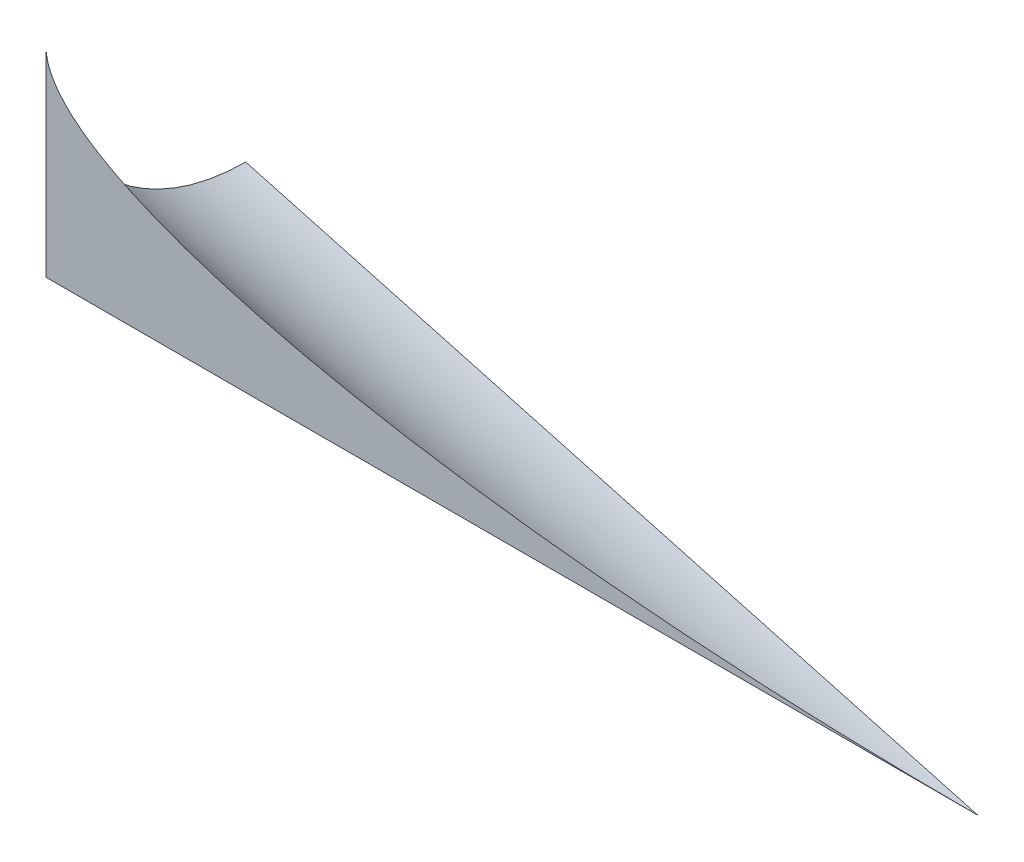
ISO-10303-21;
HEADER;
FILE_DESCRIPTION(('STEP AP214'),'2;1');
FILE_NAME('part.step','',(''),(''),'','','');
FILE_SCHEMA(('AUTOMOTIVE_DESIGN { 1 0 10303 214 1 1 1 1 }'));
ENDSEC;
DATA;
#1=APPLICATION_CONTEXT('core data for automotive mechanical design processes');
#2=APPLICATION_PROTOCOL_DEFINITION('international standard','automotive_design',2000,#1);
#3=PRODUCT_CONTEXT('',#1,'mechanical');
#4=PRODUCT('Part','Part','',(#3));
#5=PRODUCT_RELATED_PRODUCT_CATEGORY('part','',(#4));
#6=PRODUCT_DEFINITION_FORMATION('','',#4);
#7=PRODUCT_DEFINITION_CONTEXT('part definition',#1,'design');
#8=PRODUCT_DEFINITION('design','',#6,#7);
#9=PRODUCT_DEFINITION_SHAPE('','',#8);
#10=(LENGTH_UNIT() NAMED_UNIT(*) SI_UNIT(.MILLI.,.METRE.));
#11=(NAMED_UNIT(*) PLANE_ANGLE_UNIT() SI_UNIT($,.RADIAN.));
#12=(NAMED_UNIT(*) SI_UNIT($,.STERADIAN.) SOLID_ANGLE_UNIT());
#13=UNCERTAINTY_MEASURE_WITH_UNIT(LENGTH_MEASURE(1.E-05),#10,'distance_accuracy_value','');
#14=(GEOMETRIC_REPRESENTATION_CONTEXT(3) GLOBAL_UNCERTAINTY_ASSIGNED_CONTEXT((#13)) GLOBAL_UNIT_ASSIGNED_CONTEXT((#10,
#11,#12)) REPRESENTATION_CONTEXT('',''));
#15=CARTESIAN_POINT('',(0.,0.,0.));
#16=DIRECTION('',(0.,0.,1.));
#17=DIRECTION('',(1.,0.,0.));
#18=AXIS2_PLACEMENT_3D('',#15,#16,#17);
#19=CARTESIAN_POINT('',(70.,0.,0.));
#20=DIRECTION('',(0.,0.,-1.));
#21=DIRECTION('',(-1.,0.,0.));
#22=AXIS2_PLACEMENT_3D('',#19,#20,#21);
#23=PLANE('',#22);
#24=CARTESIAN_POINT('',(0.,15.,0.));
#25=CARTESIAN_POINT('',(-3.63660619727924E-06,14.9416797201866,0.));
#26=CARTESIAN_POINT('',(0.00158799671305643,14.8833713625419,0.));
#27=CARTESIAN_POINT('',(0.00792342881544762,14.7669350517663,0.));
#28=CARTESIAN_POINT('',(0.0126667331019242,14.7088070717713,0.));
#29=CARTESIAN_POINT('',(0.0315360967114692,14.5351887119626,0.));
#30=CARTESIAN_POINT('',(0.0503020053934032,14.4201730371477,0.));
#31=CARTESIAN_POINT('',(0.0989940874013959,14.1947272654307,0.));
#32=CARTESIAN_POINT('',(0.128715334241776,14.0842519732819,0.));
#33=CARTESIAN_POINT('',(0.19828864153702,13.8664977455663,0.));
#34=CARTESIAN_POINT('',(0.238146433679211,13.7592206568868,0.));
#35=CARTESIAN_POINT('',(0.336941329424818,13.5242763985346,0.));
#36=CARTESIAN_POINT('',(0.39815754814037,13.3975703748656,0.));
#37=CARTESIAN_POINT('',(0.531837614136608,13.1502757636842,0.));
#38=CARTESIAN_POINT('',(0.604304278949745,13.029688718658,0.));
#39=CARTESIAN_POINT('',(0.759023327721108,12.7938113342404,0.));
#40=CARTESIAN_POINT('',(0.841340078549202,12.6785635176265,0.));
#41=CARTESIAN_POINT('',(1.01364735337626,12.4540106430114,0.));
#42=CARTESIAN_POINT('',(1.1036378081401,12.3447055314074,0.));
#43=CARTESIAN_POINT('',(1.36899046280035,12.0411384860095,0.));
#44=CARTESIAN_POINT('',(1.55197279485321,11.8535283837303,0.));
#45=CARTESIAN_POINT('',(1.93309957195739,11.4943771196236,0.));
#46=CARTESIAN_POINT('',(2.13125804643337,11.3228511604695,0.));
#47=CARTESIAN_POINT('',(2.53875216874704,10.993298567786,0.));
#48=CARTESIAN_POINT('',(2.74809902135869,10.8352858951645,2.24750434950866E-13));
#49=CARTESIAN_POINT('',(3.17491252228697,10.5309377356269,-2.24652907264791E-13));
#50=CARTESIAN_POINT('',(3.39237560769774,10.3845972112937,-8.38363395489756E-13));
#51=CARTESIAN_POINT('',(3.79933964351344,10.1238000544291,-7.2683406795201E-13));
#52=CARTESIAN_POINT('',(3.9879362152439,10.0079220289254,-1.94792729622459E-13));
#53=CARTESIAN_POINT('',(4.36883546232187,9.78240270478851,1.94810197500429E-13));
#54=CARTESIAN_POINT('',(4.56113846849459,9.6727619663606,0.));
#55=CARTESIAN_POINT('',(4.94902738184981,9.45890999454986,0.));
#56=CARTESIAN_POINT('',(5.14461689821293,9.35470532692088,0.));
#57=CARTESIAN_POINT('',(5.53837771732633,9.15128357379421,0.));
#58=CARTESIAN_POINT('',(5.73654916582174,9.05206677140135,0.));
#59=CARTESIAN_POINT('',(6.33489750678614,8.76087070118379,0.));
#60=CARTESIAN_POINT('',(6.73836705818669,8.57564005659975,0.));
#61=CARTESIAN_POINT('',(7.55184718150086,8.22003012820233,0.));
#62=CARTESIAN_POINT('',(7.96185929465577,8.04965440676047,0.));
#63=CARTESIAN_POINT('',(8.78909896141301,7.72062253991202,0.));
#64=CARTESIAN_POINT('',(9.20635347629733,7.56203442448619,0.));
#65=CARTESIAN_POINT('',(10.0443528425527,7.25599575487862,0.));
#66=CARTESIAN_POINT('',(10.4650930132975,7.10853232480601,0.));
#67=CARTESIAN_POINT('',(11.3095551473358,6.82323058800587,0.));
#68=CARTESIAN_POINT('',(11.7332753358362,6.6853870113796,0.));
#69=CARTESIAN_POINT('',(12.5832972785961,6.41815434873623,0.));
#70=CARTESIAN_POINT('',(13.0095986465151,6.2887640300584,0.));
#71=CARTESIAN_POINT('',(13.9083448397191,6.02460914388393,0.));
#72=CARTESIAN_POINT('',(14.3810286927217,5.89065919081945,0.));
#73=CARTESIAN_POINT('',(15.3286480081518,5.63094729304768,0.));
#74=CARTESIAN_POINT('',(15.8035835333809,5.50518557817794,0.));
#75=CARTESIAN_POINT('',(16.7556201904174,5.26098505395116,0.));
#76=CARTESIAN_POINT('',(17.2327224069842,5.14255048099791,0.));
#77=CARTESIAN_POINT('',(18.188552438535,4.91242146923049,0.));
#78=CARTESIAN_POINT('',(18.6672802797161,4.80072713958517,0.));
#79=CARTESIAN_POINT('',(20.1060334973665,4.47478751961319,0.));
#80=CARTESIAN_POINT('',(21.068165186435,4.26980318428094,0.));
#81=CARTESIAN_POINT('',(22.9967219937272,3.88098173252049,0.));
#82=CARTESIAN_POINT('',(23.9631474046052,3.69714608125698,0.));
#83=CARTESIAN_POINT('',(25.896363850175,3.34857029928486,0.));
#84=CARTESIAN_POINT('',(26.8631446682574,3.18377331881414,0.));
#85=CARTESIAN_POINT('',(28.7989922766365,2.87069711426926,0.));
#86=CARTESIAN_POINT('',(29.7680580699458,2.72241169856148,0.));
#87=CARTESIAN_POINT('',(31.7081779605063,2.44075685961862,0.));
#88=CARTESIAN_POINT('',(32.6792316874287,2.30738487732229,0.));
#89=CARTESIAN_POINT('',(34.6230741796986,2.05429405451251,0.));
#90=CARTESIAN_POINT('',(35.5958628798481,1.93457471149044,0.));
#91=CARTESIAN_POINT('',(37.6791107579697,1.69191560491805,0.));
#92=CARTESIAN_POINT('',(38.7897902178065,1.57086854000406,0.));
#93=CARTESIAN_POINT('',(41.0128037887493,1.3440000990598,0.));
#94=CARTESIAN_POINT('',(42.125138047668,1.23818017737441,0.));
#95=CARTESIAN_POINT('',(44.3511961273619,1.04081964466208,0.));
#96=CARTESIAN_POINT('',(45.4649200911137,0.949280650553655,0.));
#97=CARTESIAN_POINT('',(47.6935053606347,0.779727325414758,0.));
#98=CARTESIAN_POINT('',(48.8083667683599,0.701714338281896,0.));
#99=CARTESIAN_POINT('',(51.0389876471249,0.558612674122894,0.));
#100=CARTESIAN_POINT('',(52.1547471706341,0.493524817040189,0.));
#101=CARTESIAN_POINT('',(54.3853871936608,0.375881076316622,0.));
#102=CARTESIAN_POINT('',(55.5002667934572,0.323308090499159,0.));
#103=CARTESIAN_POINT('',(57.7304691470951,0.230211703753154,0.));
#104=CARTESIAN_POINT('',(58.845791874585,0.189687670087469,0.));
#105=CARTESIAN_POINT('',(61.0766463671227,0.120416465232,0.));
#106=CARTESIAN_POINT('',(62.1921780812733,0.0916676512383976,0.));
#107=CARTESIAN_POINT('',(64.4232182049194,0.0457498428426269,0.));
#108=CARTESIAN_POINT('',(65.538726558852,0.0285781418671018,0.));
#109=CARTESIAN_POINT('',(67.7694902878698,0.00571183244050842,0.));
#110=CARTESIAN_POINT('',(68.8847456238221,1.34115856096303E-05,0.));
#111=CARTESIAN_POINT('',(70.,0.,0.));
#112=B_SPLINE_CURVE_WITH_KNOTS('',3,(#24,#25,#26,#27,#28,#29,#30,#31,#32,#33,#34,#35,#36,#37,
#38,#39,#40,#41,#42,#43,#44,#45,#46,#47,#48,#49,#50,#51,#52,#53,#54,#55,#56,#57,#58,#59,#60,#61,
#62,#63,#64,#65,#66,#67,#68,#69,#70,#71,#72,#73,#74,#75,#76,#77,#78,#79,#80,#81,#82,#83,#84,#85,
#86,#87,#88,#89,#90,#91,#92,#93,#94,#95,#96,#97,#98,#99,#100,#101,#102,#103,#104,#105,#106,#107,
#108,#109,#110,#111),.UNSPECIFIED.,.F.,.F.,(4,2,2,2,2,2,2,2,2,2,2,2,2,2,2,2,2,2,2,2,2,2,2,2,2,2,
2,2,2,2,2,2,2,2,2,2,2,2,2,2,2,2,2,4),(0.,0.174916028507103,0.349804619196399,0.698713773888168,
1.04140267124691,1.3842857738044,1.80574581667926,2.2273115796835,2.65180033164246,
3.07628525410499,3.86112809555294,4.64670544382071,5.4330848263414,6.2191229692041,
6.88304761882909,7.54703180535151,8.21180022557048,8.87660633469059,10.2080651725745,
11.5398424355001,12.8787893018371,14.2161618847846,15.5527959888396,16.8892347467977,
18.3630412151018,19.8368890342025,21.3115811880366,22.7862972204228,25.7371630290879,
28.6882331485292,31.630250192778,34.5711602749209,37.5115649365079,40.4518613365419,
43.803513679782,47.1554859272594,50.5078374175187,53.8605217952767,57.2134187924789,
60.5617072473188,63.9098198394961,67.2574651650456,70.6043275844901,73.9500777066526),.UNSPECIFIED.);
#113=CARTESIAN_POINT('',(0.,15.,0.));
#114=VERTEX_POINT('',#113);
#115=CARTESIAN_POINT('',(70.,0.,0.));
#116=VERTEX_POINT('',#115);
#117=EDGE_CURVE('E57',#114,#116,#112,.T.);
#118=ORIENTED_EDGE('',*,*,#117,.F.);
#119=DIRECTION('',(0.,-1.,0.));
#120=VECTOR('',#119,1.);
#121=CARTESIAN_POINT('',(0.,0.,0.));
#122=LINE('',#121,#120);
#123=CARTESIAN_POINT('',(0.,0.,0.));
#124=VERTEX_POINT('',#123);
#125=EDGE_CURVE('E63',#114,#124,#122,.T.);
#126=ORIENTED_EDGE('',*,*,#125,.T.);
#127=DIRECTION('',(-1.,0.,0.));
#128=VECTOR('',#127,1.);
#129=CARTESIAN_POINT('',(70.,0.,0.));
#130=LINE('',#129,#128);
#131=EDGE_CURVE('E37',#116,#124,#130,.T.);
#132=ORIENTED_EDGE('',*,*,#131,.F.);
#133=EDGE_LOOP('',(#118,#126,#132));
#134=FACE_BOUND('',#133,.T.);
#135=ADVANCED_FACE('F33',(#134),#23,.F.);
#136=CARTESIAN_POINT('',(70.,0.,0.));
#137=DIRECTION('',(0.,1.,0.));
#138=DIRECTION('',(0.,0.,1.));
#139=AXIS2_PLACEMENT_3D('',#136,#137,#138);
#140=PLANE('',#139);
#141=DIRECTION('',(0.,0.,-1.));
#142=VECTOR('',#141,1.);
#143=CARTESIAN_POINT('',(0.,0.,0.));
#144=LINE('',#143,#142);
#145=CARTESIAN_POINT('',(0.,0.,-15.));
#146=VERTEX_POINT('',#145);
#147=EDGE_CURVE('E68',#124,#146,#144,.T.);
#148=ORIENTED_EDGE('',*,*,#147,.T.);
#149=DIRECTION('',(0.977802414077409,0.,0.209529088730873));
#150=VECTOR('',#149,1.);
#151=CARTESIAN_POINT('',(-1.00023861810054,0.,-15.2143368467358));
#152=LINE('',#151,#150);
#153=EDGE_CURVE('E11',#146,#116,#152,.T.);
#154=ORIENTED_EDGE('',*,*,#153,.T.);
#155=ORIENTED_EDGE('',*,*,#131,.T.);
#156=EDGE_LOOP('',(#148,#154,#155));
#157=FACE_BOUND('',#156,.T.);
#158=ADVANCED_FACE('F67',(#157),#140,.F.);
#159=CARTESIAN_POINT('',(0.,0.,0.));
#160=DIRECTION('',(-1.,0.,0.));
#161=DIRECTION('',(0.,0.,1.));
#162=AXIS2_PLACEMENT_3D('',#159,#160,#161);
#163=PLANE('',#162);
#164=CARTESIAN_POINT('',(0.,0.,-15.));
#165=CARTESIAN_POINT('',(0.,-4.53655645734542E-05,-14.5781091128024));
#166=CARTESIAN_POINT('',(0.,0.0177972882038559,-14.1562247412463));
#167=CARTESIAN_POINT('',(0.,0.0889309735316458,-13.3154744819859));
#168=CARTESIAN_POINT('',(0.,0.142220304648244,-12.8966084504605));
#169=CARTESIAN_POINT('',(0.,0.28386620676841,-12.0651735183838));
#170=CARTESIAN_POINT('',(0.,0.372196249920546,-11.652600098764));
#171=CARTESIAN_POINT('',(0.,0.58328100603723,-10.83636145296));
#172=CARTESIAN_POINT('',(0.,0.706035298778612,-10.4326961180979));
#173=CARTESIAN_POINT('',(0.,0.985168921092279,-9.63694228084863));
#174=CARTESIAN_POINT('',(0.,1.14156460985925,-9.24485951672981));
#175=CARTESIAN_POINT('',(0.,1.48683262533932,-8.47526417746285));
#176=CARTESIAN_POINT('',(0.,1.67570495913211,-8.09775160549095));
#177=CARTESIAN_POINT('',(0.,2.08454794040079,-7.36004525621706));
#178=CARTESIAN_POINT('',(0.,2.30451317708539,-6.99984848020201));
#179=CARTESIAN_POINT('',(0.,2.77400181246558,-6.2992657686178));
#180=CARTESIAN_POINT('',(0.,3.02352505192002,-5.95887972633476));
#181=CARTESIAN_POINT('',(0.,3.55035445406677,-5.30033911065094));
#182=CARTESIAN_POINT('',(0.,3.82766034578778,-4.98218432047443));
#183=CARTESIAN_POINT('',(0.,4.40808749515107,-4.37036237513932));
#184=CARTESIAN_POINT('',(0.,4.71120889062417,-4.07669535073923));
#185=CARTESIAN_POINT('',(0.,5.34117467795882,-3.5158818007462));
#186=CARTESIAN_POINT('',(0.,5.66802382595374,-3.24874061770288));
#187=CARTESIAN_POINT('',(0.,6.34306144639887,-2.74294942675402));
#188=CARTESIAN_POINT('',(0.,6.69124959035355,-2.5042989804247));
#189=CARTESIAN_POINT('',(0.,7.40656687121694,-2.05713661992116));
#190=CARTESIAN_POINT('',(0.,7.7736997776458,-1.84863073535975));
#191=CARTESIAN_POINT('',(0.,8.52422859026486,-1.46329640447777));
#192=CARTESIAN_POINT('',(0.,8.90762462371376,-1.28646820609115));
#193=CARTESIAN_POINT('',(0.,9.6877856722118,-0.965823172037951));
#194=CARTESIAN_POINT('',(0.,10.0845442998625,-0.821990813958746));
#195=CARTESIAN_POINT('',(0.,10.8886102433383,-0.56828949056116));
#196=CARTESIAN_POINT('',(0.,11.2959149978668,-0.458412360984244));
#197=CARTESIAN_POINT('',(0.,12.2473896272249,-0.244346217808977));
#198=CARTESIAN_POINT('',(0.,12.7944676298442,-0.152719415507454));
#199=CARTESIAN_POINT('',(0.,13.6194385152426,-0.0611027908368757));
#200=CARTESIAN_POINT('',(0.,13.8949950557476,-0.0382012033252767));
#201=CARTESIAN_POINT('',(0.,14.4470116261991,-0.00764953260081119));
#202=CARTESIAN_POINT('',(0.,14.7234718369493,-2.71574079515337E-06));
#203=CARTESIAN_POINT('',(0.,15.,0.));
#204=B_SPLINE_CURVE_WITH_KNOTS('',3,(#164,#165,#166,#167,#168,#169,#170,#171,#172,#173,#174,
#175,#176,#177,#178,#179,#180,#181,#182,#183,#184,#185,#186,#187,#188,#189,#190,#191,#192,#193,
#194,#195,#196,#197,#198,#199,#200,#201,#202,#203),.UNSPECIFIED.,.F.,.F.,(4,2,2,2,2,2,2,2,2,2,2,
2,2,2,2,2,2,2,2,4),(0.,1.26528633830921,2.53051198286646,3.79478160059314,5.0590357858191,
6.32390615016246,7.58877679023912,8.8534275877129,10.1180715723006,11.3827032236926,
12.6473416274669,13.9122342266416,15.1771073587692,16.4422331459094,17.707368834465,
18.9719081322543,20.2361431448616,21.8963769384548,22.7255425850935,23.5548857537065),.UNSPECIFIED.);
#205=EDGE_CURVE('E51',#146,#114,#204,.T.);
#206=ORIENTED_EDGE('',*,*,#205,.F.);
#207=ORIENTED_EDGE('',*,*,#147,.F.);
#208=ORIENTED_EDGE('',*,*,#125,.F.);
#209=EDGE_LOOP('',(#206,#207,#208));
#210=FACE_BOUND('',#209,.T.);
#211=ADVANCED_FACE('F81',(#210),#163,.T.);
#212=CARTESIAN_POINT('',(-1.00023861810054,0.,-15.2143368467358));
#213=CARTESIAN_POINT('',(71.0002386181005,0.,0.214336846735819));
#214=CARTESIAN_POINT('',(-1.00023861810054,0.,-6.42754028233226));
#215=CARTESIAN_POINT('',(71.0002386181005,0.,9.00113341113939));
#216=CARTESIAN_POINT('',(-1.00023861810054,6.21320343559643,-0.214336846735826));
#217=CARTESIAN_POINT('',(71.0002386181005,6.21320343559642,15.2143368467358));
#218=CARTESIAN_POINT('',(-1.00023861810054,15.,-0.214336846735826));
#219=CARTESIAN_POINT('',(71.0002386181005,15.,15.2143368467358));
#220=(BOUNDED_SURFACE() B_SPLINE_SURFACE(3,1,((#212,#213),(#214,#215),(#216,#217),(#218,#219)),
.UNSPECIFIED.,.F.,.F.,.F.) B_SPLINE_SURFACE_WITH_KNOTS((4,4),(2,2),(0.,1.),(0.,1.),
.UNSPECIFIED.) GEOMETRIC_REPRESENTATION_ITEM() RATIONAL_B_SPLINE_SURFACE(((1.,1.),
(0.804737854124365,0.804737854124365),(0.804737854124365,0.804737854124365),(1.,1.))) REPRESENTATION_ITEM('') SURFACE());
#221=ORIENTED_EDGE('',*,*,#117,.T.);
#222=ORIENTED_EDGE('',*,*,#153,.F.);
#223=ORIENTED_EDGE('',*,*,#205,.T.);
#224=EDGE_LOOP('',(#221,#222,#223));
#225=FACE_BOUND('',#224,.T.);
#226=ADVANCED_FACE('F58',(#225),#220,.T.);
#227=CLOSED_SHELL('',(#135,#158,#211,#226));
#228=MANIFOLD_SOLID_BREP('B2',#227);
#229=ADVANCED_BREP_SHAPE_REPRESENTATION('',(#18,#228),#14);
#230=SHAPE_DEFINITION_REPRESENTATION(#9,#229);
ENDSEC;
END-ISO-10303-21;
